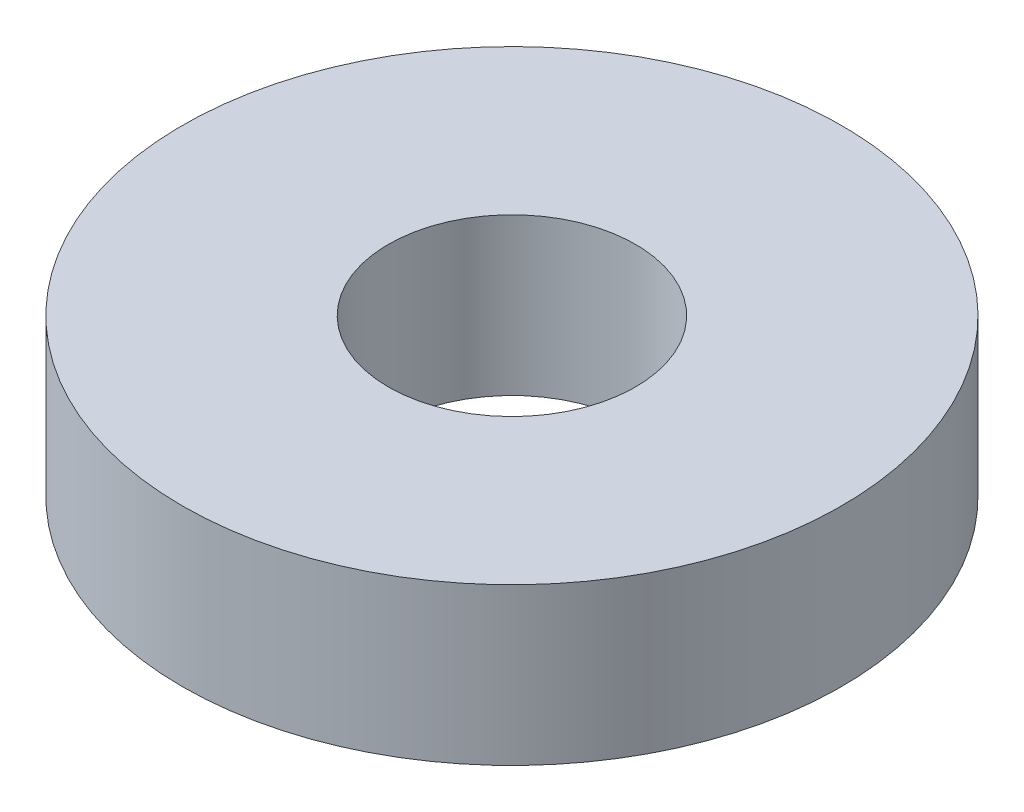
ISO-10303-21;
HEADER;
FILE_DESCRIPTION(('STEP AP214'),'2;1');
FILE_NAME('part.step','',(''),(''),'','','');
FILE_SCHEMA(('AUTOMOTIVE_DESIGN { 1 0 10303 214 1 1 1 1 }'));
ENDSEC;
DATA;
#1=APPLICATION_CONTEXT('core data for automotive mechanical design processes');
#2=APPLICATION_PROTOCOL_DEFINITION('international standard','automotive_design',2000,#1);
#3=PRODUCT_CONTEXT('',#1,'mechanical');
#4=PRODUCT('Part','Part','',(#3));
#5=PRODUCT_RELATED_PRODUCT_CATEGORY('part','',(#4));
#6=PRODUCT_DEFINITION_FORMATION('','',#4);
#7=PRODUCT_DEFINITION_CONTEXT('part definition',#1,'design');
#8=PRODUCT_DEFINITION('design','',#6,#7);
#9=PRODUCT_DEFINITION_SHAPE('','',#8);
#10=(LENGTH_UNIT() NAMED_UNIT(*) SI_UNIT(.MILLI.,.METRE.));
#11=(NAMED_UNIT(*) PLANE_ANGLE_UNIT() SI_UNIT($,.RADIAN.));
#12=(NAMED_UNIT(*) SI_UNIT($,.STERADIAN.) SOLID_ANGLE_UNIT());
#13=UNCERTAINTY_MEASURE_WITH_UNIT(LENGTH_MEASURE(1.E-05),#10,'distance_accuracy_value','');
#14=(GEOMETRIC_REPRESENTATION_CONTEXT(3) GLOBAL_UNCERTAINTY_ASSIGNED_CONTEXT((#13)) GLOBAL_UNIT_ASSIGNED_CONTEXT((#10,
#11,#12)) REPRESENTATION_CONTEXT('',''));
#15=CARTESIAN_POINT('',(0.,0.,0.));
#16=DIRECTION('',(0.,0.,1.));
#17=DIRECTION('',(1.,0.,0.));
#18=AXIS2_PLACEMENT_3D('',#15,#16,#17);
#19=CARTESIAN_POINT('',(0.,1.9,0.));
#20=DIRECTION('',(0.,1.,0.));
#21=DIRECTION('',(0.,0.,1.));
#22=AXIS2_PLACEMENT_3D('',#19,#20,#21);
#23=PLANE('',#22);
#24=CARTESIAN_POINT('',(0.,1.9,0.));
#25=DIRECTION('',(0.,1.,0.));
#26=DIRECTION('',(0.,0.,1.));
#27=AXIS2_PLACEMENT_3D('',#24,#25,#26);
#28=CIRCLE('',#27,4.);
#29=CARTESIAN_POINT('',(0.,1.9,4.));
#30=VERTEX_POINT('',#29);
#31=EDGE_CURVE('E10',#30,#30,#28,.T.);
#32=ORIENTED_EDGE('',*,*,#31,.T.);
#33=EDGE_LOOP('',(#32));
#34=FACE_BOUND('',#33,.T.);
#35=CARTESIAN_POINT('',(0.,1.9,0.));
#36=DIRECTION('',(0.,1.,0.));
#37=DIRECTION('',(0.,0.,1.));
#38=AXIS2_PLACEMENT_3D('',#35,#36,#37);
#39=CIRCLE('',#38,1.5);
#40=CARTESIAN_POINT('',(0.,1.9,1.5));
#41=VERTEX_POINT('',#40);
#42=EDGE_CURVE('E48',#41,#41,#39,.T.);
#43=ORIENTED_EDGE('',*,*,#42,.F.);
#44=EDGE_LOOP('',(#43));
#45=FACE_BOUND('',#44,.T.);
#46=ADVANCED_FACE('F40',(#34,#45),#23,.T.);
#47=CARTESIAN_POINT('',(0.,0.,0.));
#48=DIRECTION('',(0.,1.,0.));
#49=DIRECTION('',(0.,0.,1.));
#50=AXIS2_PLACEMENT_3D('',#47,#48,#49);
#51=PLANE('',#50);
#52=CARTESIAN_POINT('',(0.,0.,0.));
#53=DIRECTION('',(0.,1.,0.));
#54=DIRECTION('',(0.,0.,1.));
#55=AXIS2_PLACEMENT_3D('',#52,#53,#54);
#56=CIRCLE('',#55,4.);
#57=CARTESIAN_POINT('',(0.,0.,4.));
#58=VERTEX_POINT('',#57);
#59=EDGE_CURVE('E41',#58,#58,#56,.T.);
#60=ORIENTED_EDGE('',*,*,#59,.F.);
#61=EDGE_LOOP('',(#60));
#62=FACE_BOUND('',#61,.T.);
#63=CARTESIAN_POINT('',(0.,0.,0.));
#64=DIRECTION('',(0.,1.,0.));
#65=DIRECTION('',(0.,0.,1.));
#66=AXIS2_PLACEMENT_3D('',#63,#64,#65);
#67=CIRCLE('',#66,1.5);
#68=CARTESIAN_POINT('',(0.,0.,1.5));
#69=VERTEX_POINT('',#68);
#70=EDGE_CURVE('E49',#69,#69,#67,.T.);
#71=ORIENTED_EDGE('',*,*,#70,.T.);
#72=EDGE_LOOP('',(#71));
#73=FACE_BOUND('',#72,.T.);
#74=ADVANCED_FACE('F58',(#62,#73),#51,.F.);
#75=CARTESIAN_POINT('',(0.,1.9,0.));
#76=DIRECTION('',(0.,-1.,0.));
#77=DIRECTION('',(0.,0.,-1.));
#78=AXIS2_PLACEMENT_3D('',#75,#76,#77);
#79=CYLINDRICAL_SURFACE('',#78,4.);
#80=ORIENTED_EDGE('',*,*,#31,.F.);
#81=EDGE_LOOP('',(#80));
#82=FACE_BOUND('',#81,.T.);
#83=ORIENTED_EDGE('',*,*,#59,.T.);
#84=EDGE_LOOP('',(#83));
#85=FACE_BOUND('',#84,.T.);
#86=ADVANCED_FACE('F39',(#82,#85),#79,.T.);
#87=CARTESIAN_POINT('',(0.,1.9,0.));
#88=DIRECTION('',(0.,-1.,0.));
#89=DIRECTION('',(0.,0.,-1.));
#90=AXIS2_PLACEMENT_3D('',#87,#88,#89);
#91=CYLINDRICAL_SURFACE('',#90,1.5);
#92=ORIENTED_EDGE('',*,*,#42,.T.);
#93=EDGE_LOOP('',(#92));
#94=FACE_BOUND('',#93,.T.);
#95=ORIENTED_EDGE('',*,*,#70,.F.);
#96=EDGE_LOOP('',(#95));
#97=FACE_BOUND('',#96,.T.);
#98=ADVANCED_FACE('F57',(#94,#97),#91,.F.);
#99=CLOSED_SHELL('',(#46,#74,#86,#98));
#100=MANIFOLD_SOLID_BREP('B2',#99);
#101=ADVANCED_BREP_SHAPE_REPRESENTATION('',(#18,#100),#14);
#102=SHAPE_DEFINITION_REPRESENTATION(#9,#101);
ENDSEC;
END-ISO-10303-21;
